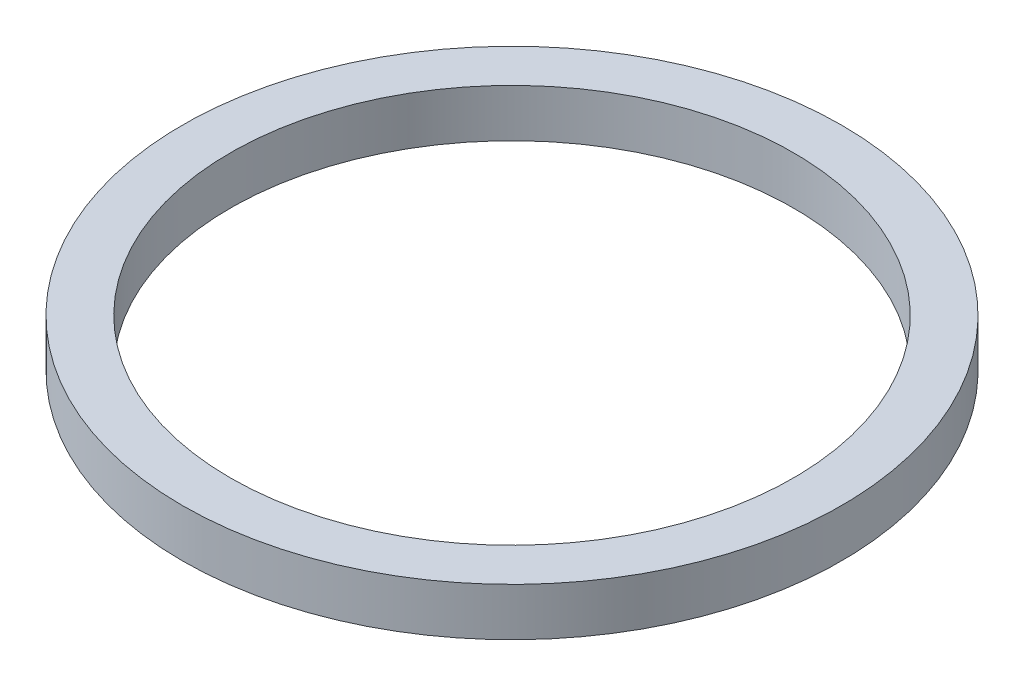
ISO-10303-21;
HEADER;
FILE_DESCRIPTION(('STEP AP214'),'2;1');
FILE_NAME('part.step','',(''),(''),'','','');
FILE_SCHEMA(('AUTOMOTIVE_DESIGN { 1 0 10303 214 1 1 1 1 }'));
ENDSEC;
DATA;
#1=APPLICATION_CONTEXT('core data for automotive mechanical design processes');
#2=APPLICATION_PROTOCOL_DEFINITION('international standard','automotive_design',2000,#1);
#3=PRODUCT_CONTEXT('',#1,'mechanical');
#4=PRODUCT('Part','Part','',(#3));
#5=PRODUCT_RELATED_PRODUCT_CATEGORY('part','',(#4));
#6=PRODUCT_DEFINITION_FORMATION('','',#4);
#7=PRODUCT_DEFINITION_CONTEXT('part definition',#1,'design');
#8=PRODUCT_DEFINITION('design','',#6,#7);
#9=PRODUCT_DEFINITION_SHAPE('','',#8);
#10=(LENGTH_UNIT() NAMED_UNIT(*) SI_UNIT(.MILLI.,.METRE.));
#11=(NAMED_UNIT(*) PLANE_ANGLE_UNIT() SI_UNIT($,.RADIAN.));
#12=(NAMED_UNIT(*) SI_UNIT($,.STERADIAN.) SOLID_ANGLE_UNIT());
#13=UNCERTAINTY_MEASURE_WITH_UNIT(LENGTH_MEASURE(1.E-05),#10,'distance_accuracy_value','');
#14=(GEOMETRIC_REPRESENTATION_CONTEXT(3) GLOBAL_UNCERTAINTY_ASSIGNED_CONTEXT((#13)) GLOBAL_UNIT_ASSIGNED_CONTEXT((#10,
#11,#12)) REPRESENTATION_CONTEXT('',''));
#15=CARTESIAN_POINT('',(0.,0.,0.));
#16=DIRECTION('',(0.,0.,1.));
#17=DIRECTION('',(1.,0.,0.));
#18=AXIS2_PLACEMENT_3D('',#15,#16,#17);
#19=CARTESIAN_POINT('',(0.,2.,0.));
#20=DIRECTION('',(0.,1.,0.));
#21=DIRECTION('',(0.,0.,1.));
#22=AXIS2_PLACEMENT_3D('',#19,#20,#21);
#23=PLANE('',#22);
#24=CARTESIAN_POINT('',(0.,2.,0.));
#25=DIRECTION('',(0.,1.,0.));
#26=DIRECTION('',(0.,0.,1.));
#27=AXIS2_PLACEMENT_3D('',#24,#25,#26);
#28=CIRCLE('',#27,13.75);
#29=CARTESIAN_POINT('',(0.,2.,13.75));
#30=VERTEX_POINT('',#29);
#31=EDGE_CURVE('E10',#30,#30,#28,.T.);
#32=ORIENTED_EDGE('',*,*,#31,.T.);
#33=EDGE_LOOP('',(#32));
#34=FACE_BOUND('',#33,.T.);
#35=CARTESIAN_POINT('',(0.,2.,0.));
#36=DIRECTION('',(0.,1.,0.));
#37=DIRECTION('',(0.,0.,1.));
#38=AXIS2_PLACEMENT_3D('',#35,#36,#37);
#39=CIRCLE('',#38,11.75);
#40=CARTESIAN_POINT('',(0.,2.,11.75));
#41=VERTEX_POINT('',#40);
#42=EDGE_CURVE('E41',#41,#41,#39,.T.);
#43=ORIENTED_EDGE('',*,*,#42,.F.);
#44=EDGE_LOOP('',(#43));
#45=FACE_BOUND('',#44,.T.);
#46=ADVANCED_FACE('F30',(#34,#45),#23,.T.);
#47=CARTESIAN_POINT('',(0.,0.,0.));
#48=DIRECTION('',(0.,1.,0.));
#49=DIRECTION('',(0.,0.,1.));
#50=AXIS2_PLACEMENT_3D('',#47,#48,#49);
#51=PLANE('',#50);
#52=CARTESIAN_POINT('',(0.,0.,0.));
#53=DIRECTION('',(0.,1.,0.));
#54=DIRECTION('',(0.,0.,1.));
#55=AXIS2_PLACEMENT_3D('',#52,#53,#54);
#56=CIRCLE('',#55,13.75);
#57=CARTESIAN_POINT('',(0.,0.,13.75));
#58=VERTEX_POINT('',#57);
#59=EDGE_CURVE('E34',#58,#58,#56,.T.);
#60=ORIENTED_EDGE('',*,*,#59,.F.);
#61=EDGE_LOOP('',(#60));
#62=FACE_BOUND('',#61,.T.);
#63=CARTESIAN_POINT('',(0.,0.,0.));
#64=DIRECTION('',(0.,1.,0.));
#65=DIRECTION('',(0.,0.,1.));
#66=AXIS2_PLACEMENT_3D('',#63,#64,#65);
#67=CIRCLE('',#66,11.75);
#68=CARTESIAN_POINT('',(0.,0.,11.75));
#69=VERTEX_POINT('',#68);
#70=EDGE_CURVE('E43',#69,#69,#67,.T.);
#71=ORIENTED_EDGE('',*,*,#70,.T.);
#72=EDGE_LOOP('',(#71));
#73=FACE_BOUND('',#72,.T.);
#74=ADVANCED_FACE('F53',(#62,#73),#51,.F.);
#75=CARTESIAN_POINT('',(0.,2.,0.));
#76=DIRECTION('',(0.,-1.,0.));
#77=DIRECTION('',(0.,0.,-1.));
#78=AXIS2_PLACEMENT_3D('',#75,#76,#77);
#79=CYLINDRICAL_SURFACE('',#78,13.75);
#80=ORIENTED_EDGE('',*,*,#31,.F.);
#81=EDGE_LOOP('',(#80));
#82=FACE_BOUND('',#81,.T.);
#83=ORIENTED_EDGE('',*,*,#59,.T.);
#84=EDGE_LOOP('',(#83));
#85=FACE_BOUND('',#84,.T.);
#86=ADVANCED_FACE('F32',(#82,#85),#79,.T.);
#87=CARTESIAN_POINT('',(0.,2.,0.));
#88=DIRECTION('',(0.,-1.,0.));
#89=DIRECTION('',(0.,0.,-1.));
#90=AXIS2_PLACEMENT_3D('',#87,#88,#89);
#91=CYLINDRICAL_SURFACE('',#90,11.75);
#92=ORIENTED_EDGE('',*,*,#42,.T.);
#93=EDGE_LOOP('',(#92));
#94=FACE_BOUND('',#93,.T.);
#95=ORIENTED_EDGE('',*,*,#70,.F.);
#96=EDGE_LOOP('',(#95));
#97=FACE_BOUND('',#96,.T.);
#98=ADVANCED_FACE('F49',(#94,#97),#91,.F.);
#99=CLOSED_SHELL('',(#46,#74,#86,#98));
#100=MANIFOLD_SOLID_BREP('B2',#99);
#101=ADVANCED_BREP_SHAPE_REPRESENTATION('',(#18,#100),#14);
#102=SHAPE_DEFINITION_REPRESENTATION(#9,#101);
ENDSEC;
END-ISO-10303-21;
